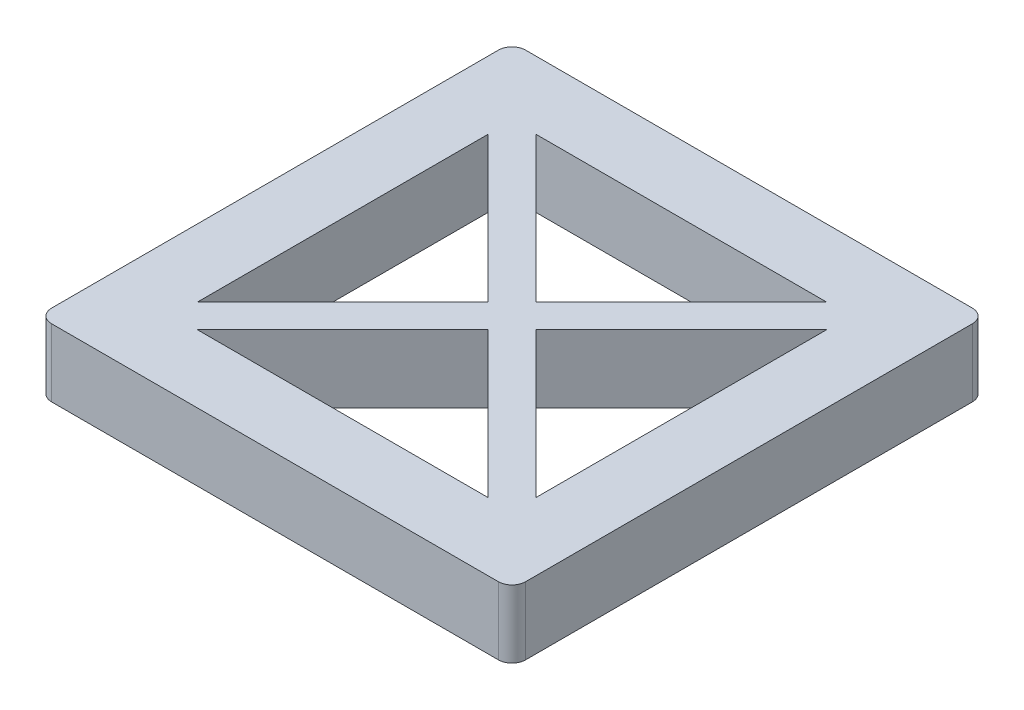
ISO-10303-21;
HEADER;
FILE_DESCRIPTION(('STEP AP214'),'2;1');
FILE_NAME('part.step','',(''),(''),'','','');
FILE_SCHEMA(('AUTOMOTIVE_DESIGN { 1 0 10303 214 1 1 1 1 }'));
ENDSEC;
DATA;
#1=APPLICATION_CONTEXT('core data for automotive mechanical design processes');
#2=APPLICATION_PROTOCOL_DEFINITION('international standard','automotive_design',2000,#1);
#3=PRODUCT_CONTEXT('',#1,'mechanical');
#4=PRODUCT('Part','Part','',(#3));
#5=PRODUCT_RELATED_PRODUCT_CATEGORY('part','',(#4));
#6=PRODUCT_DEFINITION_FORMATION('','',#4);
#7=PRODUCT_DEFINITION_CONTEXT('part definition',#1,'design');
#8=PRODUCT_DEFINITION('design','',#6,#7);
#9=PRODUCT_DEFINITION_SHAPE('','',#8);
#10=(LENGTH_UNIT() NAMED_UNIT(*) SI_UNIT(.MILLI.,.METRE.));
#11=(NAMED_UNIT(*) PLANE_ANGLE_UNIT() SI_UNIT($,.RADIAN.));
#12=(NAMED_UNIT(*) SI_UNIT($,.STERADIAN.) SOLID_ANGLE_UNIT());
#13=UNCERTAINTY_MEASURE_WITH_UNIT(LENGTH_MEASURE(1.E-05),#10,'distance_accuracy_value','');
#14=(GEOMETRIC_REPRESENTATION_CONTEXT(3) GLOBAL_UNCERTAINTY_ASSIGNED_CONTEXT((#13)) GLOBAL_UNIT_ASSIGNED_CONTEXT((#10,
#11,#12)) REPRESENTATION_CONTEXT('',''));
#15=CARTESIAN_POINT('',(0.,0.,0.));
#16=DIRECTION('',(0.,0.,1.));
#17=DIRECTION('',(1.,0.,0.));
#18=AXIS2_PLACEMENT_3D('',#15,#16,#17);
#19=CARTESIAN_POINT('',(88.9,9.525,0.));
#20=DIRECTION('',(1.,0.,0.));
#21=DIRECTION('',(0.,0.,-1.));
#22=AXIS2_PLACEMENT_3D('',#19,#20,#21);
#23=PLANE('',#22);
#24=DIRECTION('',(0.,0.,-1.));
#25=VECTOR('',#24,1.);
#26=CARTESIAN_POINT('',(88.9,12.7,88.9));
#27=LINE('',#26,#25);
#28=CARTESIAN_POINT('',(88.9,12.7,86.36));
#29=VERTEX_POINT('',#28);
#30=CARTESIAN_POINT('',(88.9,12.7,2.54));
#31=VERTEX_POINT('',#30);
#32=EDGE_CURVE('E229',#29,#31,#27,.T.);
#33=ORIENTED_EDGE('',*,*,#32,.F.);
#34=DIRECTION('',(0.,-1.,0.));
#35=VECTOR('',#34,1.);
#36=CARTESIAN_POINT('',(88.9,0.,86.36));
#37=LINE('',#36,#35);
#38=CARTESIAN_POINT('',(88.9,0.,86.36));
#39=VERTEX_POINT('',#38);
#40=EDGE_CURVE('E327',#29,#39,#37,.T.);
#41=ORIENTED_EDGE('',*,*,#40,.T.);
#42=DIRECTION('',(0.,0.,1.));
#43=VECTOR('',#42,1.);
#44=CARTESIAN_POINT('',(88.9,0.,0.));
#45=LINE('',#44,#43);
#46=CARTESIAN_POINT('',(88.9,0.,2.54));
#47=VERTEX_POINT('',#46);
#48=EDGE_CURVE('E292',#47,#39,#45,.T.);
#49=ORIENTED_EDGE('',*,*,#48,.F.);
#50=DIRECTION('',(0.,-1.,0.));
#51=VECTOR('',#50,1.);
#52=CARTESIAN_POINT('',(88.9,9.525,2.54));
#53=LINE('',#52,#51);
#54=EDGE_CURVE('E307',#47,#31,#53,.F.);
#55=ORIENTED_EDGE('',*,*,#54,.T.);
#56=EDGE_LOOP('',(#33,#41,#49,#55));
#57=FACE_BOUND('',#56,.T.);
#58=ADVANCED_FACE('F36',(#57),#23,.T.);
#59=CARTESIAN_POINT('',(0.,9.525,0.));
#60=DIRECTION('',(0.,0.,-1.));
#61=DIRECTION('',(-1.,0.,0.));
#62=AXIS2_PLACEMENT_3D('',#59,#60,#61);
#63=PLANE('',#62);
#64=DIRECTION('',(-1.,0.,0.));
#65=VECTOR('',#64,1.);
#66=CARTESIAN_POINT('',(88.9,12.7,0.));
#67=LINE('',#66,#65);
#68=CARTESIAN_POINT('',(86.36,12.7,0.));
#69=VERTEX_POINT('',#68);
#70=CARTESIAN_POINT('',(2.54,12.7,0.));
#71=VERTEX_POINT('',#70);
#72=EDGE_CURVE('E232',#69,#71,#67,.T.);
#73=ORIENTED_EDGE('',*,*,#72,.F.);
#74=DIRECTION('',(0.,-1.,0.));
#75=VECTOR('',#74,1.);
#76=CARTESIAN_POINT('',(86.36,9.525,0.));
#77=LINE('',#76,#75);
#78=CARTESIAN_POINT('',(86.36,0.,0.));
#79=VERTEX_POINT('',#78);
#80=EDGE_CURVE('E352',#69,#79,#77,.T.);
#81=ORIENTED_EDGE('',*,*,#80,.T.);
#82=DIRECTION('',(1.,0.,0.));
#83=VECTOR('',#82,1.);
#84=CARTESIAN_POINT('',(0.,0.,0.));
#85=LINE('',#84,#83);
#86=CARTESIAN_POINT('',(2.54,0.,0.));
#87=VERTEX_POINT('',#86);
#88=EDGE_CURVE('E295',#87,#79,#85,.T.);
#89=ORIENTED_EDGE('',*,*,#88,.F.);
#90=DIRECTION('',(0.,-1.,0.));
#91=VECTOR('',#90,1.);
#92=CARTESIAN_POINT('',(2.54,12.7,0.));
#93=LINE('',#92,#91);
#94=EDGE_CURVE('E350',#87,#71,#93,.F.);
#95=ORIENTED_EDGE('',*,*,#94,.T.);
#96=EDGE_LOOP('',(#73,#81,#89,#95));
#97=FACE_BOUND('',#96,.T.);
#98=ADVANCED_FACE('F358',(#97),#63,.T.);
#99=CARTESIAN_POINT('',(0.,9.525,0.));
#100=DIRECTION('',(1.,0.,0.));
#101=DIRECTION('',(0.,0.,-1.));
#102=AXIS2_PLACEMENT_3D('',#99,#100,#101);
#103=PLANE('',#102);
#104=DIRECTION('',(0.,0.,1.));
#105=VECTOR('',#104,1.);
#106=CARTESIAN_POINT('',(0.,12.7,0.));
#107=LINE('',#106,#105);
#108=CARTESIAN_POINT('',(0.,12.7,2.54));
#109=VERTEX_POINT('',#108);
#110=CARTESIAN_POINT('',(0.,12.7,86.36));
#111=VERTEX_POINT('',#110);
#112=EDGE_CURVE('E234',#109,#111,#107,.T.);
#113=ORIENTED_EDGE('',*,*,#112,.F.);
#114=DIRECTION('',(0.,-1.,0.));
#115=VECTOR('',#114,1.);
#116=CARTESIAN_POINT('',(0.,0.,2.54));
#117=LINE('',#116,#115);
#118=CARTESIAN_POINT('',(0.,0.,2.54));
#119=VERTEX_POINT('',#118);
#120=EDGE_CURVE('E11',#109,#119,#117,.T.);
#121=ORIENTED_EDGE('',*,*,#120,.T.);
#122=DIRECTION('',(0.,0.,1.));
#123=VECTOR('',#122,1.);
#124=CARTESIAN_POINT('',(0.,0.,0.));
#125=LINE('',#124,#123);
#126=CARTESIAN_POINT('',(0.,0.,86.36));
#127=VERTEX_POINT('',#126);
#128=EDGE_CURVE('E298',#119,#127,#125,.T.);
#129=ORIENTED_EDGE('',*,*,#128,.T.);
#130=DIRECTION('',(0.,-1.,0.));
#131=VECTOR('',#130,1.);
#132=CARTESIAN_POINT('',(0.,9.525,86.36));
#133=LINE('',#132,#131);
#134=EDGE_CURVE('E44',#127,#111,#133,.F.);
#135=ORIENTED_EDGE('',*,*,#134,.T.);
#136=EDGE_LOOP('',(#113,#121,#129,#135));
#137=FACE_BOUND('',#136,.T.);
#138=ADVANCED_FACE('F369',(#137),#103,.F.);
#139=CARTESIAN_POINT('',(-2.24506403026729,9.525,2.24506403026729));
#140=DIRECTION('',(0.707106781186547,0.,-0.707106781186548));
#141=DIRECTION('',(-0.707106781186548,0.,-0.707106781186547));
#142=AXIS2_PLACEMENT_3D('',#139,#140,#141);
#143=PLANE('',#142);
#144=DIRECTION('',(0.707106781186548,0.,0.707106781186547));
#145=VECTOR('',#144,1.);
#146=CARTESIAN_POINT('',(-2.24506403026729,0.,2.24506403026729));
#147=LINE('',#146,#145);
#148=CARTESIAN_POINT('',(12.7,0.,17.1901280605346));
#149=VERTEX_POINT('',#148);
#150=CARTESIAN_POINT('',(39.9598719394654,0.,44.45));
#151=VERTEX_POINT('',#150);
#152=EDGE_CURVE('E274',#149,#151,#147,.T.);
#153=ORIENTED_EDGE('',*,*,#152,.T.);
#154=DIRECTION('',(0.,-1.,0.));
#155=VECTOR('',#154,1.);
#156=CARTESIAN_POINT('',(39.9598719394654,9.525,44.45));
#157=LINE('',#156,#155);
#158=CARTESIAN_POINT('',(39.9598719394654,12.7,44.45));
#159=VERTEX_POINT('',#158);
#160=EDGE_CURVE('E185',#159,#151,#157,.T.);
#161=ORIENTED_EDGE('',*,*,#160,.F.);
#162=DIRECTION('',(-0.707106781186548,0.,-0.707106781186547));
#163=VECTOR('',#162,1.);
#164=CARTESIAN_POINT('',(12.7,12.7,17.1901280605346));
#165=LINE('',#164,#163);
#166=CARTESIAN_POINT('',(12.7,12.7,17.1901280605346));
#167=VERTEX_POINT('',#166);
#168=EDGE_CURVE('E195',#159,#167,#165,.T.);
#169=ORIENTED_EDGE('',*,*,#168,.T.);
#170=DIRECTION('',(0.,-1.,0.));
#171=VECTOR('',#170,1.);
#172=CARTESIAN_POINT('',(12.7,9.525,17.1901280605346));
#173=LINE('',#172,#171);
#174=EDGE_CURVE('E186',#167,#149,#173,.T.);
#175=ORIENTED_EDGE('',*,*,#174,.T.);
#176=EDGE_LOOP('',(#153,#161,#169,#175));
#177=FACE_BOUND('',#176,.T.);
#178=ADVANCED_FACE('F425',(#177),#143,.F.);
#179=CARTESIAN_POINT('',(42.2049359697327,9.525,42.2049359697327));
#180=DIRECTION('',(-0.707106781186548,0.,-0.707106781186548));
#181=DIRECTION('',(-0.707106781186548,0.,0.707106781186548));
#182=AXIS2_PLACEMENT_3D('',#179,#180,#181);
#183=PLANE('',#182);
#184=DIRECTION('',(0.707106781186548,0.,-0.707106781186548));
#185=VECTOR('',#184,1.);
#186=CARTESIAN_POINT('',(42.2049359697327,0.,42.2049359697327));
#187=LINE('',#186,#185);
#188=CARTESIAN_POINT('',(12.7,0.,71.7098719394654));
#189=VERTEX_POINT('',#188);
#190=EDGE_CURVE('E181',#189,#151,#187,.T.);
#191=ORIENTED_EDGE('',*,*,#190,.F.);
#192=DIRECTION('',(0.,-1.,0.));
#193=VECTOR('',#192,1.);
#194=CARTESIAN_POINT('',(12.7,9.525,71.7098719394654));
#195=LINE('',#194,#193);
#196=CARTESIAN_POINT('',(12.7,12.7,71.7098719394654));
#197=VERTEX_POINT('',#196);
#198=EDGE_CURVE('E174',#197,#189,#195,.T.);
#199=ORIENTED_EDGE('',*,*,#198,.F.);
#200=DIRECTION('',(0.707106781186548,0.,-0.707106781186547));
#201=VECTOR('',#200,1.);
#202=CARTESIAN_POINT('',(12.7,12.7,71.7098719394654));
#203=LINE('',#202,#201);
#204=EDGE_CURVE('E178',#197,#159,#203,.T.);
#205=ORIENTED_EDGE('',*,*,#204,.T.);
#206=ORIENTED_EDGE('',*,*,#160,.T.);
#207=EDGE_LOOP('',(#191,#199,#205,#206));
#208=FACE_BOUND('',#207,.T.);
#209=ADVANCED_FACE('F176',(#208),#183,.T.);
#210=CARTESIAN_POINT('',(46.6950640302673,9.525,46.6950640302673));
#211=DIRECTION('',(-0.707106781186548,0.,-0.707106781186548));
#212=DIRECTION('',(-0.707106781186548,0.,0.707106781186548));
#213=AXIS2_PLACEMENT_3D('',#210,#211,#212);
#214=PLANE('',#213);
#215=DIRECTION('',(0.707106781186548,0.,-0.707106781186548));
#216=VECTOR('',#215,1.);
#217=CARTESIAN_POINT('',(46.6950640302673,0.,46.6950640302673));
#218=LINE('',#217,#216);
#219=CARTESIAN_POINT('',(17.1901280605346,0.,76.2));
#220=VERTEX_POINT('',#219);
#221=CARTESIAN_POINT('',(44.45,0.,48.9401280605346));
#222=VERTEX_POINT('',#221);
#223=EDGE_CURVE('E265',#220,#222,#218,.T.);
#224=ORIENTED_EDGE('',*,*,#223,.T.);
#225=DIRECTION('',(0.,-1.,0.));
#226=VECTOR('',#225,1.);
#227=CARTESIAN_POINT('',(44.45,9.525,48.9401280605346));
#228=LINE('',#227,#226);
#229=CARTESIAN_POINT('',(44.45,12.7,48.9401280605346));
#230=VERTEX_POINT('',#229);
#231=EDGE_CURVE('E304',#230,#222,#228,.T.);
#232=ORIENTED_EDGE('',*,*,#231,.F.);
#233=DIRECTION('',(-0.707106781186548,0.,0.707106781186547));
#234=VECTOR('',#233,1.);
#235=CARTESIAN_POINT('',(17.1901280605346,12.7,76.2));
#236=LINE('',#235,#234);
#237=CARTESIAN_POINT('',(17.1901280605346,12.7,76.2));
#238=VERTEX_POINT('',#237);
#239=EDGE_CURVE('E217',#230,#238,#236,.T.);
#240=ORIENTED_EDGE('',*,*,#239,.T.);
#241=DIRECTION('',(0.,-1.,0.));
#242=VECTOR('',#241,1.);
#243=CARTESIAN_POINT('',(17.1901280605346,9.525,76.2));
#244=LINE('',#243,#242);
#245=EDGE_CURVE('E308',#238,#220,#244,.T.);
#246=ORIENTED_EDGE('',*,*,#245,.T.);
#247=EDGE_LOOP('',(#224,#232,#240,#246));
#248=FACE_BOUND('',#247,.T.);
#249=ADVANCED_FACE('F424',(#248),#214,.F.);
#250=CARTESIAN_POINT('',(-2.24506403026729,9.525,2.24506403026729));
#251=DIRECTION('',(0.707106781186547,0.,-0.707106781186548));
#252=DIRECTION('',(-0.707106781186548,0.,-0.707106781186547));
#253=AXIS2_PLACEMENT_3D('',#250,#251,#252);
#254=PLANE('',#253);
#255=DIRECTION('',(0.707106781186548,0.,0.707106781186547));
#256=VECTOR('',#255,1.);
#257=CARTESIAN_POINT('',(-2.24506403026729,0.,2.24506403026729));
#258=LINE('',#257,#256);
#259=CARTESIAN_POINT('',(71.7098719394654,0.,76.2));
#260=VERTEX_POINT('',#259);
#261=EDGE_CURVE('E268',#222,#260,#258,.T.);
#262=ORIENTED_EDGE('',*,*,#261,.T.);
#263=DIRECTION('',(0.,-1.,0.));
#264=VECTOR('',#263,1.);
#265=CARTESIAN_POINT('',(71.7098719394654,9.525,76.2));
#266=LINE('',#265,#264);
#267=CARTESIAN_POINT('',(71.7098719394654,12.7,76.2));
#268=VERTEX_POINT('',#267);
#269=EDGE_CURVE('E310',#268,#260,#266,.T.);
#270=ORIENTED_EDGE('',*,*,#269,.F.);
#271=DIRECTION('',(-0.707106781186547,0.,-0.707106781186547));
#272=VECTOR('',#271,1.);
#273=CARTESIAN_POINT('',(44.45,12.7,48.9401280605346));
#274=LINE('',#273,#272);
#275=EDGE_CURVE('E223',#268,#230,#274,.T.);
#276=ORIENTED_EDGE('',*,*,#275,.T.);
#277=ORIENTED_EDGE('',*,*,#231,.T.);
#278=EDGE_LOOP('',(#262,#270,#276,#277));
#279=FACE_BOUND('',#278,.T.);
#280=ADVANCED_FACE('F433',(#279),#254,.F.);
#281=CARTESIAN_POINT('',(42.2049359697327,9.525,42.2049359697327));
#282=DIRECTION('',(-0.707106781186548,0.,-0.707106781186548));
#283=DIRECTION('',(-0.707106781186548,0.,0.707106781186548));
#284=AXIS2_PLACEMENT_3D('',#281,#282,#283);
#285=PLANE('',#284);
#286=DIRECTION('',(0.707106781186548,0.,-0.707106781186548));
#287=VECTOR('',#286,1.);
#288=CARTESIAN_POINT('',(42.2049359697327,0.,42.2049359697327));
#289=LINE('',#288,#287);
#290=CARTESIAN_POINT('',(44.45,0.,39.9598719394654));
#291=VERTEX_POINT('',#290);
#292=CARTESIAN_POINT('',(71.7098719394654,0.,12.7));
#293=VERTEX_POINT('',#292);
#294=EDGE_CURVE('E256',#291,#293,#289,.T.);
#295=ORIENTED_EDGE('',*,*,#294,.F.);
#296=DIRECTION('',(0.,-1.,0.));
#297=VECTOR('',#296,1.);
#298=CARTESIAN_POINT('',(44.45,9.525,39.9598719394654));
#299=LINE('',#298,#297);
#300=CARTESIAN_POINT('',(44.45,12.7,39.9598719394654));
#301=VERTEX_POINT('',#300);
#302=EDGE_CURVE('E311',#301,#291,#299,.T.);
#303=ORIENTED_EDGE('',*,*,#302,.F.);
#304=DIRECTION('',(0.707106781186547,0.,-0.707106781186548));
#305=VECTOR('',#304,1.);
#306=CARTESIAN_POINT('',(44.45,12.7,39.9598719394654));
#307=LINE('',#306,#305);
#308=CARTESIAN_POINT('',(71.7098719394654,12.7,12.7));
#309=VERTEX_POINT('',#308);
#310=EDGE_CURVE('E202',#301,#309,#307,.T.);
#311=ORIENTED_EDGE('',*,*,#310,.T.);
#312=DIRECTION('',(0.,-1.,0.));
#313=VECTOR('',#312,1.);
#314=CARTESIAN_POINT('',(71.7098719394654,9.525,12.7));
#315=LINE('',#314,#313);
#316=EDGE_CURVE('E315',#309,#293,#315,.T.);
#317=ORIENTED_EDGE('',*,*,#316,.T.);
#318=EDGE_LOOP('',(#295,#303,#311,#317));
#319=FACE_BOUND('',#318,.T.);
#320=ADVANCED_FACE('F436',(#319),#285,.T.);
#321=CARTESIAN_POINT('',(2.24506403026728,9.525,-2.24506403026728));
#322=DIRECTION('',(0.707106781186547,0.,-0.707106781186548));
#323=DIRECTION('',(-0.707106781186548,0.,-0.707106781186547));
#324=AXIS2_PLACEMENT_3D('',#321,#322,#323);
#325=PLANE('',#324);
#326=DIRECTION('',(0.707106781186548,0.,0.707106781186547));
#327=VECTOR('',#326,1.);
#328=CARTESIAN_POINT('',(2.24506403026728,0.,-2.24506403026728));
#329=LINE('',#328,#327);
#330=CARTESIAN_POINT('',(17.1901280605346,0.,12.7));
#331=VERTEX_POINT('',#330);
#332=EDGE_CURVE('E259',#331,#291,#329,.T.);
#333=ORIENTED_EDGE('',*,*,#332,.F.);
#334=DIRECTION('',(0.,-1.,0.));
#335=VECTOR('',#334,1.);
#336=CARTESIAN_POINT('',(17.1901280605346,9.525,12.7));
#337=LINE('',#336,#335);
#338=CARTESIAN_POINT('',(17.1901280605346,12.7,12.7));
#339=VERTEX_POINT('',#338);
#340=EDGE_CURVE('E317',#339,#331,#337,.T.);
#341=ORIENTED_EDGE('',*,*,#340,.F.);
#342=DIRECTION('',(0.707106781186548,0.,0.707106781186547));
#343=VECTOR('',#342,1.);
#344=CARTESIAN_POINT('',(17.1901280605346,12.7,12.7));
#345=LINE('',#344,#343);
#346=EDGE_CURVE('E197',#339,#301,#345,.T.);
#347=ORIENTED_EDGE('',*,*,#346,.T.);
#348=ORIENTED_EDGE('',*,*,#302,.T.);
#349=EDGE_LOOP('',(#333,#341,#347,#348));
#350=FACE_BOUND('',#349,.T.);
#351=ADVANCED_FACE('F445',(#350),#325,.T.);
#352=CARTESIAN_POINT('',(2.24506403026728,9.525,-2.24506403026728));
#353=DIRECTION('',(0.707106781186547,0.,-0.707106781186548));
#354=DIRECTION('',(-0.707106781186548,0.,-0.707106781186547));
#355=AXIS2_PLACEMENT_3D('',#352,#353,#354);
#356=PLANE('',#355);
#357=DIRECTION('',(0.707106781186548,0.,0.707106781186547));
#358=VECTOR('',#357,1.);
#359=CARTESIAN_POINT('',(2.24506403026728,0.,-2.24506403026728));
#360=LINE('',#359,#358);
#361=CARTESIAN_POINT('',(48.9401280605346,0.,44.45));
#362=VERTEX_POINT('',#361);
#363=CARTESIAN_POINT('',(76.2,0.,71.7098719394654));
#364=VERTEX_POINT('',#363);
#365=EDGE_CURVE('E240',#362,#364,#360,.T.);
#366=ORIENTED_EDGE('',*,*,#365,.F.);
#367=DIRECTION('',(0.,-1.,0.));
#368=VECTOR('',#367,1.);
#369=CARTESIAN_POINT('',(48.9401280605346,9.525,44.45));
#370=LINE('',#369,#368);
#371=CARTESIAN_POINT('',(48.9401280605346,12.7,44.45));
#372=VERTEX_POINT('',#371);
#373=EDGE_CURVE('E318',#372,#362,#370,.T.);
#374=ORIENTED_EDGE('',*,*,#373,.F.);
#375=DIRECTION('',(0.707106781186548,0.,0.707106781186547));
#376=VECTOR('',#375,1.);
#377=CARTESIAN_POINT('',(48.9401280605346,12.7,44.45));
#378=LINE('',#377,#376);
#379=CARTESIAN_POINT('',(76.2,12.7,71.7098719394654));
#380=VERTEX_POINT('',#379);
#381=EDGE_CURVE('E211',#372,#380,#378,.T.);
#382=ORIENTED_EDGE('',*,*,#381,.T.);
#383=DIRECTION('',(0.,-1.,0.));
#384=VECTOR('',#383,1.);
#385=CARTESIAN_POINT('',(76.2,9.525,71.7098719394654));
#386=LINE('',#385,#384);
#387=EDGE_CURVE('E303',#380,#364,#386,.T.);
#388=ORIENTED_EDGE('',*,*,#387,.T.);
#389=EDGE_LOOP('',(#366,#374,#382,#388));
#390=FACE_BOUND('',#389,.T.);
#391=ADVANCED_FACE('F448',(#390),#356,.T.);
#392=CARTESIAN_POINT('',(46.6950640302673,9.525,46.6950640302673));
#393=DIRECTION('',(-0.707106781186548,0.,-0.707106781186548));
#394=DIRECTION('',(-0.707106781186548,0.,0.707106781186548));
#395=AXIS2_PLACEMENT_3D('',#392,#393,#394);
#396=PLANE('',#395);
#397=DIRECTION('',(0.707106781186548,0.,-0.707106781186548));
#398=VECTOR('',#397,1.);
#399=CARTESIAN_POINT('',(46.6950640302673,0.,46.6950640302673));
#400=LINE('',#399,#398);
#401=CARTESIAN_POINT('',(76.2,0.,17.1901280605346));
#402=VERTEX_POINT('',#401);
#403=EDGE_CURVE('E251',#362,#402,#400,.T.);
#404=ORIENTED_EDGE('',*,*,#403,.T.);
#405=DIRECTION('',(0.,-1.,0.));
#406=VECTOR('',#405,1.);
#407=CARTESIAN_POINT('',(76.2,9.525,17.1901280605346));
#408=LINE('',#407,#406);
#409=CARTESIAN_POINT('',(76.2,12.7,17.1901280605346));
#410=VERTEX_POINT('',#409);
#411=EDGE_CURVE('E322',#410,#402,#408,.T.);
#412=ORIENTED_EDGE('',*,*,#411,.F.);
#413=DIRECTION('',(-0.707106781186547,0.,0.707106781186548));
#414=VECTOR('',#413,1.);
#415=CARTESIAN_POINT('',(48.9401280605346,12.7,44.45));
#416=LINE('',#415,#414);
#417=EDGE_CURVE('E208',#410,#372,#416,.T.);
#418=ORIENTED_EDGE('',*,*,#417,.T.);
#419=ORIENTED_EDGE('',*,*,#373,.T.);
#420=EDGE_LOOP('',(#404,#412,#418,#419));
#421=FACE_BOUND('',#420,.T.);
#422=ADVANCED_FACE('F406',(#421),#396,.F.);
#423=CARTESIAN_POINT('',(6.35,9.525,6.35));
#424=DIRECTION('',(0.,-1.,0.));
#425=DIRECTION('',(0.,0.,-1.));
#426=AXIS2_PLACEMENT_3D('',#423,#424,#425);
#427=CYLINDRICAL_SURFACE('',#426,3.175);
#428=CARTESIAN_POINT('',(6.35,9.525,6.35));
#429=DIRECTION('',(0.,1.,0.));
#430=DIRECTION('',(0.,0.,1.));
#431=AXIS2_PLACEMENT_3D('',#428,#429,#430);
#432=CIRCLE('',#431,3.175);
#433=CARTESIAN_POINT('',(6.35,9.525,9.525));
#434=VERTEX_POINT('',#433);
#435=EDGE_CURVE('E236',#434,#434,#432,.T.);
#436=ORIENTED_EDGE('',*,*,#435,.T.);
#437=EDGE_LOOP('',(#436));
#438=FACE_BOUND('',#437,.T.);
#439=CARTESIAN_POINT('',(6.35,0.,6.35));
#440=DIRECTION('',(0.,1.,0.));
#441=DIRECTION('',(0.,0.,1.));
#442=AXIS2_PLACEMENT_3D('',#439,#440,#441);
#443=CIRCLE('',#442,3.175);
#444=CARTESIAN_POINT('',(6.35,0.,9.525));
#445=VERTEX_POINT('',#444);
#446=EDGE_CURVE('E289',#445,#445,#443,.T.);
#447=ORIENTED_EDGE('',*,*,#446,.F.);
#448=EDGE_LOOP('',(#447));
#449=FACE_BOUND('',#448,.T.);
#450=ADVANCED_FACE('F402',(#438,#449),#427,.F.);
#451=CARTESIAN_POINT('',(6.35000000000001,9.525,82.55));
#452=DIRECTION('',(0.,-1.,0.));
#453=DIRECTION('',(0.,0.,-1.));
#454=AXIS2_PLACEMENT_3D('',#451,#452,#453);
#455=CYLINDRICAL_SURFACE('',#454,3.175);
#456=CARTESIAN_POINT('',(6.35000000000001,9.525,82.55));
#457=DIRECTION('',(0.,1.,0.));
#458=DIRECTION('',(0.,0.,1.));
#459=AXIS2_PLACEMENT_3D('',#456,#457,#458);
#460=CIRCLE('',#459,3.175);
#461=CARTESIAN_POINT('',(6.35000000000001,9.525,85.725));
#462=VERTEX_POINT('',#461);
#463=EDGE_CURVE('E244',#462,#462,#460,.T.);
#464=ORIENTED_EDGE('',*,*,#463,.T.);
#465=EDGE_LOOP('',(#464));
#466=FACE_BOUND('',#465,.T.);
#467=CARTESIAN_POINT('',(6.35000000000001,0.,82.55));
#468=DIRECTION('',(0.,1.,0.));
#469=DIRECTION('',(0.,0.,1.));
#470=AXIS2_PLACEMENT_3D('',#467,#468,#469);
#471=CIRCLE('',#470,3.175);
#472=CARTESIAN_POINT('',(6.35000000000001,0.,85.725));
#473=VERTEX_POINT('',#472);
#474=EDGE_CURVE('E286',#473,#473,#471,.T.);
#475=ORIENTED_EDGE('',*,*,#474,.F.);
#476=EDGE_LOOP('',(#475));
#477=FACE_BOUND('',#476,.T.);
#478=ADVANCED_FACE('F405',(#466,#477),#455,.F.);
#479=CARTESIAN_POINT('',(82.55,9.525,82.55));
#480=DIRECTION('',(0.,-1.,0.));
#481=DIRECTION('',(0.,0.,-1.));
#482=AXIS2_PLACEMENT_3D('',#479,#480,#481);
#483=CYLINDRICAL_SURFACE('',#482,3.175);
#484=CARTESIAN_POINT('',(82.55,9.525,82.55));
#485=DIRECTION('',(0.,1.,0.));
#486=DIRECTION('',(0.,0.,1.));
#487=AXIS2_PLACEMENT_3D('',#484,#485,#486);
#488=CIRCLE('',#487,3.175);
#489=CARTESIAN_POINT('',(82.55,9.525,85.725));
#490=VERTEX_POINT('',#489);
#491=EDGE_CURVE('E241',#490,#490,#488,.T.);
#492=ORIENTED_EDGE('',*,*,#491,.T.);
#493=EDGE_LOOP('',(#492));
#494=FACE_BOUND('',#493,.T.);
#495=CARTESIAN_POINT('',(82.55,0.,82.55));
#496=DIRECTION('',(0.,1.,0.));
#497=DIRECTION('',(0.,0.,1.));
#498=AXIS2_PLACEMENT_3D('',#495,#496,#497);
#499=CIRCLE('',#498,3.175);
#500=CARTESIAN_POINT('',(82.55,0.,85.725));
#501=VERTEX_POINT('',#500);
#502=EDGE_CURVE('E283',#501,#501,#499,.T.);
#503=ORIENTED_EDGE('',*,*,#502,.F.);
#504=EDGE_LOOP('',(#503));
#505=FACE_BOUND('',#504,.T.);
#506=ADVANCED_FACE('F410',(#494,#505),#483,.F.);
#507=CARTESIAN_POINT('',(82.55,9.525,6.35));
#508=DIRECTION('',(0.,-1.,0.));
#509=DIRECTION('',(0.,0.,-1.));
#510=AXIS2_PLACEMENT_3D('',#507,#508,#509);
#511=CYLINDRICAL_SURFACE('',#510,3.175);
#512=CARTESIAN_POINT('',(82.55,9.525,6.35));
#513=DIRECTION('',(0.,1.,0.));
#514=DIRECTION('',(0.,0.,1.));
#515=AXIS2_PLACEMENT_3D('',#512,#513,#514);
#516=CIRCLE('',#515,3.175);
#517=CARTESIAN_POINT('',(82.55,9.525,9.525));
#518=VERTEX_POINT('',#517);
#519=EDGE_CURVE('E237',#518,#518,#516,.T.);
#520=ORIENTED_EDGE('',*,*,#519,.T.);
#521=EDGE_LOOP('',(#520));
#522=FACE_BOUND('',#521,.T.);
#523=CARTESIAN_POINT('',(82.55,0.,6.35));
#524=DIRECTION('',(0.,1.,0.));
#525=DIRECTION('',(0.,0.,1.));
#526=AXIS2_PLACEMENT_3D('',#523,#524,#525);
#527=CIRCLE('',#526,3.175);
#528=CARTESIAN_POINT('',(82.55,0.,9.525));
#529=VERTEX_POINT('',#528);
#530=EDGE_CURVE('E280',#529,#529,#527,.T.);
#531=ORIENTED_EDGE('',*,*,#530,.F.);
#532=EDGE_LOOP('',(#531));
#533=FACE_BOUND('',#532,.T.);
#534=ADVANCED_FACE('F414',(#522,#533),#511,.F.);
#535=CARTESIAN_POINT('',(12.7,9.525,0.));
#536=DIRECTION('',(1.,0.,0.));
#537=DIRECTION('',(0.,0.,-1.));
#538=AXIS2_PLACEMENT_3D('',#535,#536,#537);
#539=PLANE('',#538);
#540=DIRECTION('',(0.,0.,1.));
#541=VECTOR('',#540,1.);
#542=CARTESIAN_POINT('',(12.7,0.,0.));
#543=LINE('',#542,#541);
#544=EDGE_CURVE('E278',#149,#189,#543,.T.);
#545=ORIENTED_EDGE('',*,*,#544,.F.);
#546=ORIENTED_EDGE('',*,*,#174,.F.);
#547=DIRECTION('',(0.,0.,1.));
#548=VECTOR('',#547,1.);
#549=CARTESIAN_POINT('',(12.7,12.7,17.1901280605346));
#550=LINE('',#549,#548);
#551=EDGE_CURVE('E189',#167,#197,#550,.T.);
#552=ORIENTED_EDGE('',*,*,#551,.T.);
#553=ORIENTED_EDGE('',*,*,#198,.T.);
#554=EDGE_LOOP('',(#545,#546,#552,#553));
#555=FACE_BOUND('',#554,.T.);
#556=ADVANCED_FACE('F190',(#555),#539,.T.);
#557=CARTESIAN_POINT('',(0.,9.525,76.2));
#558=DIRECTION('',(0.,0.,-1.));
#559=DIRECTION('',(-1.,0.,0.));
#560=AXIS2_PLACEMENT_3D('',#557,#558,#559);
#561=PLANE('',#560);
#562=DIRECTION('',(1.,0.,0.));
#563=VECTOR('',#562,1.);
#564=CARTESIAN_POINT('',(0.,0.,76.2));
#565=LINE('',#564,#563);
#566=EDGE_CURVE('E271',#220,#260,#565,.T.);
#567=ORIENTED_EDGE('',*,*,#566,.F.);
#568=ORIENTED_EDGE('',*,*,#245,.F.);
#569=DIRECTION('',(1.,0.,0.));
#570=VECTOR('',#569,1.);
#571=CARTESIAN_POINT('',(17.1901280605346,12.7,76.2));
#572=LINE('',#571,#570);
#573=EDGE_CURVE('E220',#238,#268,#572,.T.);
#574=ORIENTED_EDGE('',*,*,#573,.T.);
#575=ORIENTED_EDGE('',*,*,#269,.T.);
#576=EDGE_LOOP('',(#567,#568,#574,#575));
#577=FACE_BOUND('',#576,.T.);
#578=ADVANCED_FACE('F421',(#577),#561,.T.);
#579=CARTESIAN_POINT('',(0.,9.525,12.7));
#580=DIRECTION('',(0.,0.,-1.));
#581=DIRECTION('',(-1.,0.,0.));
#582=AXIS2_PLACEMENT_3D('',#579,#580,#581);
#583=PLANE('',#582);
#584=DIRECTION('',(1.,0.,0.));
#585=VECTOR('',#584,1.);
#586=CARTESIAN_POINT('',(0.,0.,12.7));
#587=LINE('',#586,#585);
#588=EDGE_CURVE('E262',#331,#293,#587,.T.);
#589=ORIENTED_EDGE('',*,*,#588,.T.);
#590=ORIENTED_EDGE('',*,*,#316,.F.);
#591=DIRECTION('',(-1.,0.,0.));
#592=VECTOR('',#591,1.);
#593=CARTESIAN_POINT('',(17.1901280605346,12.7,12.7));
#594=LINE('',#593,#592);
#595=EDGE_CURVE('E205',#309,#339,#594,.T.);
#596=ORIENTED_EDGE('',*,*,#595,.T.);
#597=ORIENTED_EDGE('',*,*,#340,.T.);
#598=EDGE_LOOP('',(#589,#590,#596,#597));
#599=FACE_BOUND('',#598,.T.);
#600=ADVANCED_FACE('F431',(#599),#583,.F.);
#601=CARTESIAN_POINT('',(76.2,9.525,0.));
#602=DIRECTION('',(1.,0.,0.));
#603=DIRECTION('',(0.,0.,-1.));
#604=AXIS2_PLACEMENT_3D('',#601,#602,#603);
#605=PLANE('',#604);
#606=DIRECTION('',(0.,0.,1.));
#607=VECTOR('',#606,1.);
#608=CARTESIAN_POINT('',(76.2,0.,0.));
#609=LINE('',#608,#607);
#610=EDGE_CURVE('E253',#402,#364,#609,.T.);
#611=ORIENTED_EDGE('',*,*,#610,.T.);
#612=ORIENTED_EDGE('',*,*,#387,.F.);
#613=DIRECTION('',(0.,0.,-1.));
#614=VECTOR('',#613,1.);
#615=CARTESIAN_POINT('',(76.2,12.7,17.1901280605346));
#616=LINE('',#615,#614);
#617=EDGE_CURVE('E214',#380,#410,#616,.T.);
#618=ORIENTED_EDGE('',*,*,#617,.T.);
#619=ORIENTED_EDGE('',*,*,#411,.T.);
#620=EDGE_LOOP('',(#611,#612,#618,#619));
#621=FACE_BOUND('',#620,.T.);
#622=ADVANCED_FACE('F443',(#621),#605,.F.);
#623=CARTESIAN_POINT('',(0.,9.525,88.9));
#624=DIRECTION('',(0.,0.,-1.));
#625=DIRECTION('',(-1.,0.,0.));
#626=AXIS2_PLACEMENT_3D('',#623,#624,#625);
#627=PLANE('',#626);
#628=DIRECTION('',(1.,0.,0.));
#629=VECTOR('',#628,1.);
#630=CARTESIAN_POINT('',(0.,0.,88.9));
#631=LINE('',#630,#629);
#632=CARTESIAN_POINT('',(2.54000000000001,0.,88.9));
#633=VERTEX_POINT('',#632);
#634=CARTESIAN_POINT('',(86.36,0.,88.9));
#635=VERTEX_POINT('',#634);
#636=EDGE_CURVE('E300',#633,#635,#631,.T.);
#637=ORIENTED_EDGE('',*,*,#636,.T.);
#638=DIRECTION('',(0.,-1.,0.));
#639=VECTOR('',#638,1.);
#640=CARTESIAN_POINT('',(86.36,12.7,88.9));
#641=LINE('',#640,#639);
#642=CARTESIAN_POINT('',(86.36,12.7,88.9));
#643=VERTEX_POINT('',#642);
#644=EDGE_CURVE('E341',#635,#643,#641,.F.);
#645=ORIENTED_EDGE('',*,*,#644,.T.);
#646=DIRECTION('',(1.,0.,0.));
#647=VECTOR('',#646,1.);
#648=CARTESIAN_POINT('',(0.,12.7,88.9));
#649=LINE('',#648,#647);
#650=CARTESIAN_POINT('',(2.54000000000001,12.7,88.9));
#651=VERTEX_POINT('',#650);
#652=EDGE_CURVE('E226',#651,#643,#649,.T.);
#653=ORIENTED_EDGE('',*,*,#652,.F.);
#654=DIRECTION('',(0.,-1.,0.));
#655=VECTOR('',#654,1.);
#656=CARTESIAN_POINT('',(2.54000000000001,9.525,88.9));
#657=LINE('',#656,#655);
#658=EDGE_CURVE('E338',#651,#633,#657,.T.);
#659=ORIENTED_EDGE('',*,*,#658,.T.);
#660=EDGE_LOOP('',(#637,#645,#653,#659));
#661=FACE_BOUND('',#660,.T.);
#662=ADVANCED_FACE('F377',(#661),#627,.F.);
#663=CARTESIAN_POINT('',(0.,0.,0.));
#664=DIRECTION('',(0.,1.,0.));
#665=DIRECTION('',(0.,0.,1.));
#666=AXIS2_PLACEMENT_3D('',#663,#664,#665);
#667=PLANE('',#666);
#668=ORIENTED_EDGE('',*,*,#365,.T.);
#669=ORIENTED_EDGE('',*,*,#610,.F.);
#670=ORIENTED_EDGE('',*,*,#403,.F.);
#671=EDGE_LOOP('',(#668,#669,#670));
#672=FACE_BOUND('',#671,.T.);
#673=ORIENTED_EDGE('',*,*,#294,.T.);
#674=ORIENTED_EDGE('',*,*,#588,.F.);
#675=ORIENTED_EDGE('',*,*,#332,.T.);
#676=EDGE_LOOP('',(#673,#674,#675));
#677=FACE_BOUND('',#676,.T.);
#678=ORIENTED_EDGE('',*,*,#223,.F.);
#679=ORIENTED_EDGE('',*,*,#566,.T.);
#680=ORIENTED_EDGE('',*,*,#261,.F.);
#681=EDGE_LOOP('',(#678,#679,#680));
#682=FACE_BOUND('',#681,.T.);
#683=ORIENTED_EDGE('',*,*,#152,.F.);
#684=ORIENTED_EDGE('',*,*,#544,.T.);
#685=ORIENTED_EDGE('',*,*,#190,.T.);
#686=EDGE_LOOP('',(#683,#684,#685));
#687=FACE_BOUND('',#686,.T.);
#688=ORIENTED_EDGE('',*,*,#530,.T.);
#689=EDGE_LOOP('',(#688));
#690=FACE_BOUND('',#689,.T.);
#691=ORIENTED_EDGE('',*,*,#502,.T.);
#692=EDGE_LOOP('',(#691));
#693=FACE_BOUND('',#692,.T.);
#694=ORIENTED_EDGE('',*,*,#474,.T.);
#695=EDGE_LOOP('',(#694));
#696=FACE_BOUND('',#695,.T.);
#697=ORIENTED_EDGE('',*,*,#446,.T.);
#698=EDGE_LOOP('',(#697));
#699=FACE_BOUND('',#698,.T.);
#700=ORIENTED_EDGE('',*,*,#48,.T.);
#701=CARTESIAN_POINT('',(86.36,0.,86.36));
#702=DIRECTION('',(0.,1.,0.));
#703=DIRECTION('',(0.,0.,1.));
#704=AXIS2_PLACEMENT_3D('',#701,#702,#703);
#705=CIRCLE('',#704,2.54);
#706=EDGE_CURVE('E336',#39,#635,#705,.F.);
#707=ORIENTED_EDGE('',*,*,#706,.T.);
#708=ORIENTED_EDGE('',*,*,#636,.F.);
#709=CARTESIAN_POINT('',(2.54000000000001,0.,86.36));
#710=DIRECTION('',(0.,1.,0.));
#711=DIRECTION('',(0.,0.,1.));
#712=AXIS2_PLACEMENT_3D('',#709,#710,#711);
#713=CIRCLE('',#712,2.54);
#714=EDGE_CURVE('E330',#633,#127,#713,.F.);
#715=ORIENTED_EDGE('',*,*,#714,.T.);
#716=ORIENTED_EDGE('',*,*,#128,.F.);
#717=CARTESIAN_POINT('',(2.54,0.,2.54));
#718=DIRECTION('',(0.,1.,0.));
#719=DIRECTION('',(0.,0.,1.));
#720=AXIS2_PLACEMENT_3D('',#717,#718,#719);
#721=CIRCLE('',#720,2.54);
#722=EDGE_CURVE('E332',#119,#87,#721,.F.);
#723=ORIENTED_EDGE('',*,*,#722,.T.);
#724=ORIENTED_EDGE('',*,*,#88,.T.);
#725=CARTESIAN_POINT('',(86.36,0.,2.54));
#726=DIRECTION('',(0.,1.,0.));
#727=DIRECTION('',(0.,0.,1.));
#728=AXIS2_PLACEMENT_3D('',#725,#726,#727);
#729=CIRCLE('',#728,2.54);
#730=EDGE_CURVE('E334',#79,#47,#729,.F.);
#731=ORIENTED_EDGE('',*,*,#730,.T.);
#732=EDGE_LOOP('',(#700,#707,#708,#715,#716,#723,#724,#731));
#733=FACE_BOUND('',#732,.T.);
#734=ADVANCED_FACE('F363',(#672,#677,#682,#687,#690,#693,#696,#699,#733),#667,.F.);
#735=CARTESIAN_POINT('',(0.,9.525,0.));
#736=DIRECTION('',(0.,1.,0.));
#737=DIRECTION('',(0.,0.,1.));
#738=AXIS2_PLACEMENT_3D('',#735,#736,#737);
#739=PLANE('',#738);
#740=ORIENTED_EDGE('',*,*,#435,.F.);
#741=EDGE_LOOP('',(#740));
#742=FACE_BOUND('',#741,.T.);
#743=ADVANCED_FACE('F484',(#742),#739,.F.);
#744=ORIENTED_EDGE('',*,*,#463,.F.);
#745=EDGE_LOOP('',(#744));
#746=FACE_BOUND('',#745,.T.);
#747=ADVANCED_FACE('F509',(#746),#739,.F.);
#748=ORIENTED_EDGE('',*,*,#491,.F.);
#749=EDGE_LOOP('',(#748));
#750=FACE_BOUND('',#749,.T.);
#751=ADVANCED_FACE('F601',(#750),#739,.F.);
#752=ORIENTED_EDGE('',*,*,#519,.F.);
#753=EDGE_LOOP('',(#752));
#754=FACE_BOUND('',#753,.T.);
#755=ADVANCED_FACE('F474',(#754),#739,.F.);
#756=CARTESIAN_POINT('',(0.,12.7,0.));
#757=DIRECTION('',(0.,1.,0.));
#758=DIRECTION('',(0.,0.,1.));
#759=AXIS2_PLACEMENT_3D('',#756,#757,#758);
#760=PLANE('',#759);
#761=ORIENTED_EDGE('',*,*,#652,.T.);
#762=CARTESIAN_POINT('',(86.36,12.7,86.36));
#763=DIRECTION('',(0.,1.,0.));
#764=DIRECTION('',(0.,0.,1.));
#765=AXIS2_PLACEMENT_3D('',#762,#763,#764);
#766=CIRCLE('',#765,2.54);
#767=EDGE_CURVE('E348',#643,#29,#766,.T.);
#768=ORIENTED_EDGE('',*,*,#767,.T.);
#769=ORIENTED_EDGE('',*,*,#32,.T.);
#770=CARTESIAN_POINT('',(86.36,12.7,2.54));
#771=DIRECTION('',(0.,1.,0.));
#772=DIRECTION('',(0.,0.,1.));
#773=AXIS2_PLACEMENT_3D('',#770,#771,#772);
#774=CIRCLE('',#773,2.54);
#775=EDGE_CURVE('E346',#31,#69,#774,.T.);
#776=ORIENTED_EDGE('',*,*,#775,.T.);
#777=ORIENTED_EDGE('',*,*,#72,.T.);
#778=CARTESIAN_POINT('',(2.54,12.7,2.54));
#779=DIRECTION('',(0.,1.,0.));
#780=DIRECTION('',(0.,0.,1.));
#781=AXIS2_PLACEMENT_3D('',#778,#779,#780);
#782=CIRCLE('',#781,2.54);
#783=EDGE_CURVE('E57',#71,#109,#782,.T.);
#784=ORIENTED_EDGE('',*,*,#783,.T.);
#785=ORIENTED_EDGE('',*,*,#112,.T.);
#786=CARTESIAN_POINT('',(2.54000000000001,12.7,86.36));
#787=DIRECTION('',(0.,1.,0.));
#788=DIRECTION('',(0.,0.,1.));
#789=AXIS2_PLACEMENT_3D('',#786,#787,#788);
#790=CIRCLE('',#789,2.54);
#791=EDGE_CURVE('E343',#111,#651,#790,.T.);
#792=ORIENTED_EDGE('',*,*,#791,.T.);
#793=EDGE_LOOP('',(#761,#768,#769,#776,#777,#784,#785,#792));
#794=FACE_BOUND('',#793,.T.);
#795=ORIENTED_EDGE('',*,*,#573,.F.);
#796=ORIENTED_EDGE('',*,*,#239,.F.);
#797=ORIENTED_EDGE('',*,*,#275,.F.);
#798=EDGE_LOOP('',(#795,#796,#797));
#799=FACE_BOUND('',#798,.T.);
#800=ORIENTED_EDGE('',*,*,#381,.F.);
#801=ORIENTED_EDGE('',*,*,#417,.F.);
#802=ORIENTED_EDGE('',*,*,#617,.F.);
#803=EDGE_LOOP('',(#800,#801,#802));
#804=FACE_BOUND('',#803,.T.);
#805=ORIENTED_EDGE('',*,*,#310,.F.);
#806=ORIENTED_EDGE('',*,*,#346,.F.);
#807=ORIENTED_EDGE('',*,*,#595,.F.);
#808=EDGE_LOOP('',(#805,#806,#807));
#809=FACE_BOUND('',#808,.T.);
#810=ORIENTED_EDGE('',*,*,#204,.F.);
#811=ORIENTED_EDGE('',*,*,#551,.F.);
#812=ORIENTED_EDGE('',*,*,#168,.F.);
#813=EDGE_LOOP('',(#810,#811,#812));
#814=FACE_BOUND('',#813,.T.);
#815=ADVANCED_FACE('F194',(#794,#799,#804,#809,#814),#760,.T.);
#816=CARTESIAN_POINT('',(86.36,9.525,86.36));
#817=DIRECTION('',(0.,1.,0.));
#818=DIRECTION('',(0.,0.,1.));
#819=AXIS2_PLACEMENT_3D('',#816,#817,#818);
#820=CYLINDRICAL_SURFACE('',#819,2.54);
#821=ORIENTED_EDGE('',*,*,#767,.F.);
#822=ORIENTED_EDGE('',*,*,#644,.F.);
#823=ORIENTED_EDGE('',*,*,#706,.F.);
#824=ORIENTED_EDGE('',*,*,#40,.F.);
#825=EDGE_LOOP('',(#821,#822,#823,#824));
#826=FACE_BOUND('',#825,.T.);
#827=ADVANCED_FACE('F382',(#826),#820,.T.);
#828=CARTESIAN_POINT('',(86.36,9.525,2.54));
#829=DIRECTION('',(0.,-1.,0.));
#830=DIRECTION('',(0.,0.,-1.));
#831=AXIS2_PLACEMENT_3D('',#828,#829,#830);
#832=CYLINDRICAL_SURFACE('',#831,2.54);
#833=ORIENTED_EDGE('',*,*,#775,.F.);
#834=ORIENTED_EDGE('',*,*,#54,.F.);
#835=ORIENTED_EDGE('',*,*,#730,.F.);
#836=ORIENTED_EDGE('',*,*,#80,.F.);
#837=EDGE_LOOP('',(#833,#834,#835,#836));
#838=FACE_BOUND('',#837,.T.);
#839=ADVANCED_FACE('F386',(#838),#832,.T.);
#840=CARTESIAN_POINT('',(2.54,9.525,2.54));
#841=DIRECTION('',(0.,1.,0.));
#842=DIRECTION('',(0.,0.,1.));
#843=AXIS2_PLACEMENT_3D('',#840,#841,#842);
#844=CYLINDRICAL_SURFACE('',#843,2.54);
#845=ORIENTED_EDGE('',*,*,#783,.F.);
#846=ORIENTED_EDGE('',*,*,#94,.F.);
#847=ORIENTED_EDGE('',*,*,#722,.F.);
#848=ORIENTED_EDGE('',*,*,#120,.F.);
#849=EDGE_LOOP('',(#845,#846,#847,#848));
#850=FACE_BOUND('',#849,.T.);
#851=ADVANCED_FACE('F368',(#850),#844,.T.);
#852=CARTESIAN_POINT('',(2.54000000000001,9.525,86.36));
#853=DIRECTION('',(0.,-1.,0.));
#854=DIRECTION('',(0.,0.,-1.));
#855=AXIS2_PLACEMENT_3D('',#852,#853,#854);
#856=CYLINDRICAL_SURFACE('',#855,2.54);
#857=ORIENTED_EDGE('',*,*,#791,.F.);
#858=ORIENTED_EDGE('',*,*,#134,.F.);
#859=ORIENTED_EDGE('',*,*,#714,.F.);
#860=ORIENTED_EDGE('',*,*,#658,.F.);
#861=EDGE_LOOP('',(#857,#858,#859,#860));
#862=FACE_BOUND('',#861,.T.);
#863=ADVANCED_FACE('F38',(#862),#856,.T.);
#864=CLOSED_SHELL('',(#58,#98,#138,#178,#209,#249,#280,#320,#351,#391,#422,#450,#478,#506,#534,
#556,#578,#600,#622,#662,#734,#743,#747,#751,#755,#815,#827,#839,#851,#863));
#865=MANIFOLD_SOLID_BREP('B2',#864);
#866=ADVANCED_BREP_SHAPE_REPRESENTATION('',(#18,#865),#14);
#867=SHAPE_DEFINITION_REPRESENTATION(#9,#866);
ENDSEC;
END-ISO-10303-21;
